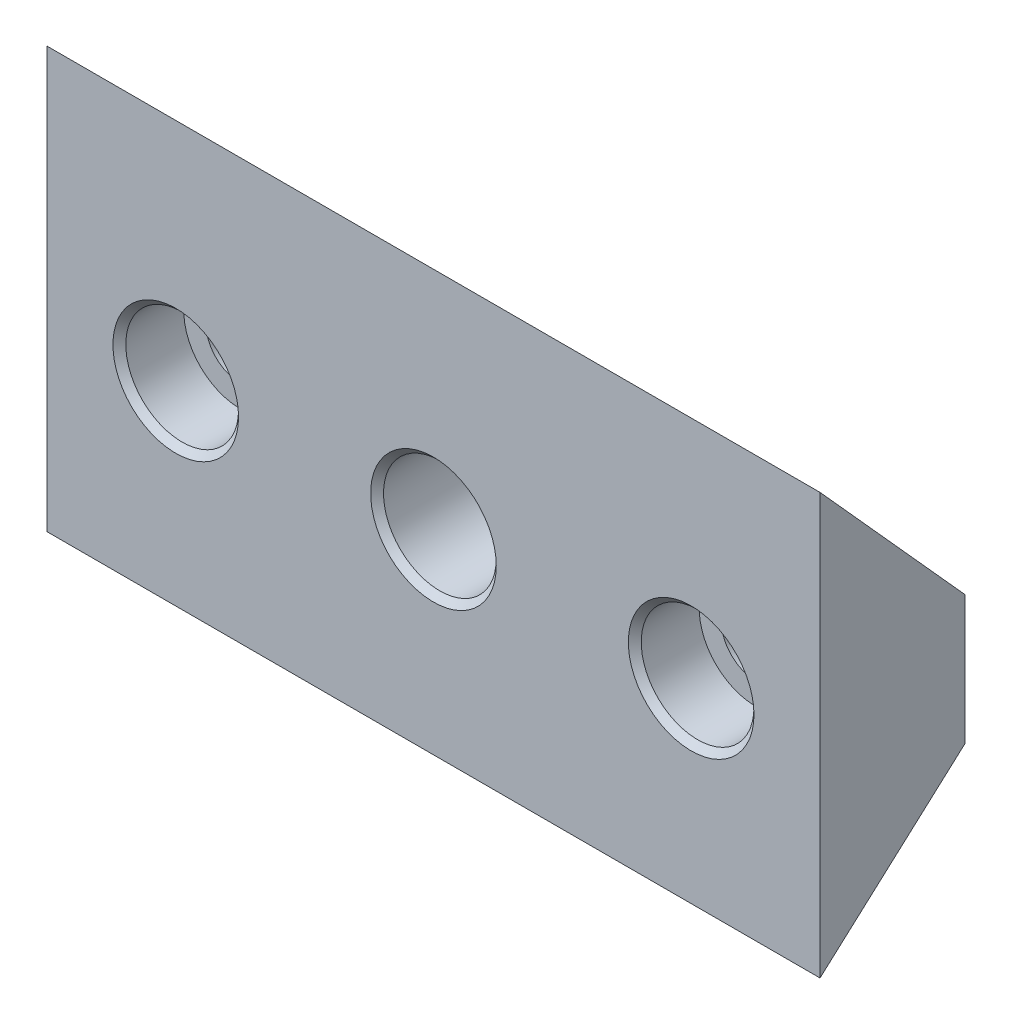
ISO-10303-21;
HEADER;
FILE_DESCRIPTION(('STEP AP214'),'2;1');
FILE_NAME('part.step','',(''),(''),'','','');
FILE_SCHEMA(('AUTOMOTIVE_DESIGN { 1 0 10303 214 1 1 1 1 }'));
ENDSEC;
DATA;
#1=APPLICATION_CONTEXT('core data for automotive mechanical design processes');
#2=APPLICATION_PROTOCOL_DEFINITION('international standard','automotive_design',2000,#1);
#3=PRODUCT_CONTEXT('',#1,'mechanical');
#4=PRODUCT('Part','Part','',(#3));
#5=PRODUCT_RELATED_PRODUCT_CATEGORY('part','',(#4));
#6=PRODUCT_DEFINITION_FORMATION('','',#4);
#7=PRODUCT_DEFINITION_CONTEXT('part definition',#1,'design');
#8=PRODUCT_DEFINITION('design','',#6,#7);
#9=PRODUCT_DEFINITION_SHAPE('','',#8);
#10=(LENGTH_UNIT() NAMED_UNIT(*) SI_UNIT(.MILLI.,.METRE.));
#11=(NAMED_UNIT(*) PLANE_ANGLE_UNIT() SI_UNIT($,.RADIAN.));
#12=(NAMED_UNIT(*) SI_UNIT($,.STERADIAN.) SOLID_ANGLE_UNIT());
#13=UNCERTAINTY_MEASURE_WITH_UNIT(LENGTH_MEASURE(1.E-05),#10,'distance_accuracy_value','');
#14=(GEOMETRIC_REPRESENTATION_CONTEXT(3) GLOBAL_UNCERTAINTY_ASSIGNED_CONTEXT((#13)) GLOBAL_UNIT_ASSIGNED_CONTEXT((#10,
#11,#12)) REPRESENTATION_CONTEXT('',''));
#15=CARTESIAN_POINT('',(0.,0.,0.));
#16=DIRECTION('',(0.,0.,1.));
#17=DIRECTION('',(1.,0.,0.));
#18=AXIS2_PLACEMENT_3D('',#15,#16,#17);
#19=CARTESIAN_POINT('',(-38.1,22.225,7.1501));
#20=DIRECTION('',(1.,0.,0.));
#21=DIRECTION('',(0.,1.,0.));
#22=AXIS2_PLACEMENT_3D('',#19,#20,#21);
#23=PLANE('',#22);
#24=DIRECTION('',(0.,0.743144825477396,-0.669130606358856));
#25=VECTOR('',#24,1.);
#26=CARTESIAN_POINT('',(-38.1,-6.39546194990181,-7.10288007967489));
#27=LINE('',#26,#25);
#28=CARTESIAN_POINT('',(-38.1,-6.37990268068199,-7.11688970860673));
#29=VERTEX_POINT('',#28);
#30=CARTESIAN_POINT('',(-38.1,-6.3430189154395,-7.1501));
#31=VERTEX_POINT('',#30);
#32=EDGE_CURVE('E105',#29,#31,#27,.T.);
#33=ORIENTED_EDGE('',*,*,#32,.F.);
#34=DIRECTION('',(0.,-0.669130606358859,0.743144825477394));
#35=VECTOR('',#34,1.);
#36=CARTESIAN_POINT('',(-38.1,-6.34999999999986,-7.15009999999925));
#37=LINE('',#36,#35);
#38=CARTESIAN_POINT('',(-38.1,-19.2259579142672,7.1501));
#39=VERTEX_POINT('',#38);
#40=EDGE_CURVE('E56',#29,#39,#37,.T.);
#41=ORIENTED_EDGE('',*,*,#40,.T.);
#42=DIRECTION('',(0.,-1.,0.));
#43=VECTOR('',#42,1.);
#44=CARTESIAN_POINT('',(-38.1,22.225,7.1501));
#45=LINE('',#44,#43);
#46=CARTESIAN_POINT('',(-38.1,22.225,7.1501));
#47=VERTEX_POINT('',#46);
#48=EDGE_CURVE('E119',#47,#39,#45,.T.);
#49=ORIENTED_EDGE('',*,*,#48,.F.);
#50=DIRECTION('',(0.,-0.743144825477396,-0.669130606358856));
#51=VECTOR('',#50,1.);
#52=CARTESIAN_POINT('',(-38.1,6.3954619499018,-7.10288007967489));
#53=LINE('',#52,#51);
#54=CARTESIAN_POINT('',(-38.1,6.3430189154395,-7.1501));
#55=VERTEX_POINT('',#54);
#56=EDGE_CURVE('E109',#47,#55,#53,.T.);
#57=ORIENTED_EDGE('',*,*,#56,.T.);
#58=DIRECTION('',(0.,-1.,0.));
#59=VECTOR('',#58,1.);
#60=CARTESIAN_POINT('',(-38.1,22.225,-7.1501));
#61=LINE('',#60,#59);
#62=EDGE_CURVE('E114',#55,#31,#61,.T.);
#63=ORIENTED_EDGE('',*,*,#62,.T.);
#64=EDGE_LOOP('',(#33,#41,#49,#57,#63));
#65=FACE_BOUND('',#64,.T.);
#66=ADVANCED_FACE('F43',(#65),#23,.F.);
#67=CARTESIAN_POINT('',(38.1,22.225,7.1501));
#68=DIRECTION('',(-1.,0.,0.));
#69=DIRECTION('',(0.,0.,1.));
#70=AXIS2_PLACEMENT_3D('',#67,#68,#69);
#71=PLANE('',#70);
#72=DIRECTION('',(0.,1.,0.));
#73=VECTOR('',#72,1.);
#74=CARTESIAN_POINT('',(38.1,22.225,7.1501));
#75=LINE('',#74,#73);
#76=CARTESIAN_POINT('',(38.1,-19.2259579142672,7.1501));
#77=VERTEX_POINT('',#76);
#78=CARTESIAN_POINT('',(38.1,22.225,7.1501));
#79=VERTEX_POINT('',#78);
#80=EDGE_CURVE('E99',#77,#79,#75,.T.);
#81=ORIENTED_EDGE('',*,*,#80,.F.);
#82=DIRECTION('',(0.,-0.669130606358859,0.743144825477394));
#83=VECTOR('',#82,1.);
#84=CARTESIAN_POINT('',(38.1,-6.34999999999986,-7.15009999999925));
#85=LINE('',#84,#83);
#86=CARTESIAN_POINT('',(38.1,-6.37990268068198,-7.11688970860675));
#87=VERTEX_POINT('',#86);
#88=EDGE_CURVE('E88',#87,#77,#85,.T.);
#89=ORIENTED_EDGE('',*,*,#88,.F.);
#90=DIRECTION('',(0.,0.743144825477396,-0.669130606358856));
#91=VECTOR('',#90,1.);
#92=CARTESIAN_POINT('',(38.1,-6.39546194990181,-7.10288007967489));
#93=LINE('',#92,#91);
#94=CARTESIAN_POINT('',(38.1,-6.3430189154395,-7.1501));
#95=VERTEX_POINT('',#94);
#96=EDGE_CURVE('E97',#87,#95,#93,.T.);
#97=ORIENTED_EDGE('',*,*,#96,.T.);
#98=DIRECTION('',(0.,1.,0.));
#99=VECTOR('',#98,1.);
#100=CARTESIAN_POINT('',(38.1,22.225,-7.1501));
#101=LINE('',#100,#99);
#102=CARTESIAN_POINT('',(38.1,6.3430189154395,-7.1501));
#103=VERTEX_POINT('',#102);
#104=EDGE_CURVE('E122',#95,#103,#101,.T.);
#105=ORIENTED_EDGE('',*,*,#104,.T.);
#106=DIRECTION('',(0.,-0.743144825477396,-0.669130606358856));
#107=VECTOR('',#106,1.);
#108=CARTESIAN_POINT('',(38.1,6.3954619499018,-7.10288007967489));
#109=LINE('',#108,#107);
#110=EDGE_CURVE('E64',#79,#103,#109,.T.);
#111=ORIENTED_EDGE('',*,*,#110,.F.);
#112=EDGE_LOOP('',(#81,#89,#97,#105,#111));
#113=FACE_BOUND('',#112,.T.);
#114=ADVANCED_FACE('F95',(#113),#71,.F.);
#115=CARTESIAN_POINT('',(0.,0.,-7.1501));
#116=DIRECTION('',(0.,0.,-1.));
#117=DIRECTION('',(-1.,0.,0.));
#118=AXIS2_PLACEMENT_3D('',#115,#116,#117);
#119=PLANE('',#118);
#120=CARTESIAN_POINT('',(0.,0.,-7.1501));
#121=DIRECTION('',(0.,0.,1.));
#122=DIRECTION('',(1.,0.,0.));
#123=AXIS2_PLACEMENT_3D('',#120,#121,#122);
#124=CIRCLE('',#123,6.19125);
#125=CARTESIAN_POINT('',(6.19125,0.,-7.1501));
#126=VERTEX_POINT('',#125);
#127=EDGE_CURVE('E136',#126,#126,#124,.T.);
#128=ORIENTED_EDGE('',*,*,#127,.T.);
#129=EDGE_LOOP('',(#128));
#130=FACE_BOUND('',#129,.T.);
#131=CARTESIAN_POINT('',(-25.4,0.,-7.1501));
#132=DIRECTION('',(0.,0.,1.));
#133=DIRECTION('',(1.,0.,0.));
#134=AXIS2_PLACEMENT_3D('',#131,#132,#133);
#135=CIRCLE('',#134,4.0132);
#136=CARTESIAN_POINT('',(-21.3868,0.,-7.1501));
#137=VERTEX_POINT('',#136);
#138=EDGE_CURVE('E151',#137,#137,#135,.T.);
#139=ORIENTED_EDGE('',*,*,#138,.T.);
#140=EDGE_LOOP('',(#139));
#141=FACE_BOUND('',#140,.T.);
#142=CARTESIAN_POINT('',(25.4,0.,-7.1501));
#143=DIRECTION('',(0.,0.,1.));
#144=DIRECTION('',(1.,0.,0.));
#145=AXIS2_PLACEMENT_3D('',#142,#143,#144);
#146=CIRCLE('',#145,4.01319999999999);
#147=CARTESIAN_POINT('',(29.4132,0.,-7.1501));
#148=VERTEX_POINT('',#147);
#149=EDGE_CURVE('E169',#148,#148,#146,.T.);
#150=ORIENTED_EDGE('',*,*,#149,.T.);
#151=EDGE_LOOP('',(#150));
#152=FACE_BOUND('',#151,.T.);
#153=ORIENTED_EDGE('',*,*,#104,.F.);
#154=DIRECTION('',(1.,0.,0.));
#155=VECTOR('',#154,1.);
#156=CARTESIAN_POINT('',(-38.1,-6.3430189154395,-7.1501));
#157=LINE('',#156,#155);
#158=EDGE_CURVE('E103',#31,#95,#157,.T.);
#159=ORIENTED_EDGE('',*,*,#158,.F.);
#160=ORIENTED_EDGE('',*,*,#62,.F.);
#161=DIRECTION('',(1.,0.,0.));
#162=VECTOR('',#161,1.);
#163=CARTESIAN_POINT('',(-38.1,6.3430189154395,-7.1501));
#164=LINE('',#163,#162);
#165=EDGE_CURVE('E106',#55,#103,#164,.T.);
#166=ORIENTED_EDGE('',*,*,#165,.T.);
#167=EDGE_LOOP('',(#153,#159,#160,#166));
#168=FACE_BOUND('',#167,.T.);
#169=ADVANCED_FACE('F128',(#130,#141,#152,#168),#119,.T.);
#170=CARTESIAN_POINT('',(0.,0.,7.1501));
#171=DIRECTION('',(0.,0.,-1.));
#172=DIRECTION('',(-1.,0.,0.));
#173=AXIS2_PLACEMENT_3D('',#170,#171,#172);
#174=PLANE('',#173);
#175=CARTESIAN_POINT('',(0.,0.,7.1501));
#176=DIRECTION('',(0.,0.,1.));
#177=DIRECTION('',(1.,0.,0.));
#178=AXIS2_PLACEMENT_3D('',#175,#176,#177);
#179=CIRCLE('',#178,6.19125);
#180=CARTESIAN_POINT('',(6.19125,0.,7.1501));
#181=VERTEX_POINT('',#180);
#182=EDGE_CURVE('E139',#181,#181,#179,.T.);
#183=ORIENTED_EDGE('',*,*,#182,.F.);
#184=EDGE_LOOP('',(#183));
#185=FACE_BOUND('',#184,.T.);
#186=CARTESIAN_POINT('',(-25.4,0.,7.1501));
#187=DIRECTION('',(0.,0.,1.));
#188=DIRECTION('',(1.,0.,0.));
#189=AXIS2_PLACEMENT_3D('',#186,#187,#188);
#190=CIRCLE('',#189,6.19125);
#191=CARTESIAN_POINT('',(-19.20875,0.,7.1501));
#192=VERTEX_POINT('',#191);
#193=EDGE_CURVE('E154',#192,#192,#190,.T.);
#194=ORIENTED_EDGE('',*,*,#193,.F.);
#195=EDGE_LOOP('',(#194));
#196=FACE_BOUND('',#195,.T.);
#197=CARTESIAN_POINT('',(25.4,0.,7.1501));
#198=DIRECTION('',(0.,0.,1.));
#199=DIRECTION('',(1.,0.,0.));
#200=AXIS2_PLACEMENT_3D('',#197,#198,#199);
#201=CIRCLE('',#200,6.19125);
#202=CARTESIAN_POINT('',(31.59125,0.,7.1501));
#203=VERTEX_POINT('',#202);
#204=EDGE_CURVE('E172',#203,#203,#201,.T.);
#205=ORIENTED_EDGE('',*,*,#204,.F.);
#206=EDGE_LOOP('',(#205));
#207=FACE_BOUND('',#206,.T.);
#208=ORIENTED_EDGE('',*,*,#48,.T.);
#209=DIRECTION('',(1.,0.,0.));
#210=VECTOR('',#209,1.);
#211=CARTESIAN_POINT('',(0.,-19.2259579142672,7.1501));
#212=LINE('',#211,#210);
#213=EDGE_CURVE('E135',#39,#77,#212,.T.);
#214=ORIENTED_EDGE('',*,*,#213,.T.);
#215=ORIENTED_EDGE('',*,*,#80,.T.);
#216=DIRECTION('',(-1.,0.,0.));
#217=VECTOR('',#216,1.);
#218=CARTESIAN_POINT('',(38.1,22.225,7.1501));
#219=LINE('',#218,#217);
#220=EDGE_CURVE('E50',#79,#47,#219,.T.);
#221=ORIENTED_EDGE('',*,*,#220,.T.);
#222=EDGE_LOOP('',(#208,#214,#215,#221));
#223=FACE_BOUND('',#222,.T.);
#224=ADVANCED_FACE('F134',(#185,#196,#207,#223),#174,.F.);
#225=CARTESIAN_POINT('',(-38.1,6.3954619499018,-7.10288007967489));
#226=DIRECTION('',(0.,-0.669130606358856,0.743144825477396));
#227=DIRECTION('',(0.,-0.743144825477396,-0.669130606358856));
#228=AXIS2_PLACEMENT_3D('',#225,#226,#227);
#229=PLANE('',#228);
#230=ORIENTED_EDGE('',*,*,#110,.T.);
#231=ORIENTED_EDGE('',*,*,#165,.F.);
#232=ORIENTED_EDGE('',*,*,#56,.F.);
#233=ORIENTED_EDGE('',*,*,#220,.F.);
#234=EDGE_LOOP('',(#230,#231,#232,#233));
#235=FACE_BOUND('',#234,.T.);
#236=ADVANCED_FACE('F130',(#235),#229,.F.);
#237=CARTESIAN_POINT('',(-38.1,-6.39546194990181,-7.10288007967489));
#238=DIRECTION('',(0.,-0.669130606358856,-0.743144825477396));
#239=DIRECTION('',(0.,0.743144825477396,-0.669130606358856));
#240=AXIS2_PLACEMENT_3D('',#237,#238,#239);
#241=PLANE('',#240);
#242=DIRECTION('',(1.,0.,0.));
#243=VECTOR('',#242,1.);
#244=CARTESIAN_POINT('',(-38.1,-6.37990268068199,-7.11688970860673));
#245=LINE('',#244,#243);
#246=EDGE_CURVE('E11',#29,#87,#245,.T.);
#247=ORIENTED_EDGE('',*,*,#246,.F.);
#248=ORIENTED_EDGE('',*,*,#32,.T.);
#249=ORIENTED_EDGE('',*,*,#158,.T.);
#250=ORIENTED_EDGE('',*,*,#96,.F.);
#251=EDGE_LOOP('',(#247,#248,#249,#250));
#252=FACE_BOUND('',#251,.T.);
#253=ADVANCED_FACE('F101',(#252),#241,.T.);
#254=CARTESIAN_POINT('',(25.4,0.,-6.5151));
#255=DIRECTION('',(0.,0.,-1.));
#256=DIRECTION('',(-1.,0.,0.));
#257=AXIS2_PLACEMENT_3D('',#254,#255,#256);
#258=CONICAL_SURFACE('',#257,3.3782,0.785398163397447);
#259=ORIENTED_EDGE('',*,*,#149,.F.);
#260=EDGE_LOOP('',(#259));
#261=FACE_BOUND('',#260,.T.);
#262=CARTESIAN_POINT('',(25.4,0.,-6.5151));
#263=DIRECTION('',(0.,0.,1.));
#264=DIRECTION('',(1.,0.,0.));
#265=AXIS2_PLACEMENT_3D('',#262,#263,#264);
#266=CIRCLE('',#265,3.3782);
#267=CARTESIAN_POINT('',(28.7782,0.,-6.5151));
#268=VERTEX_POINT('',#267);
#269=EDGE_CURVE('E117',#268,#268,#266,.T.);
#270=ORIENTED_EDGE('',*,*,#269,.T.);
#271=EDGE_LOOP('',(#270));
#272=FACE_BOUND('',#271,.T.);
#273=ADVANCED_FACE('F186',(#261,#272),#258,.F.);
#274=CARTESIAN_POINT('',(25.4,0.,7.1501));
#275=DIRECTION('',(0.,0.,1.));
#276=DIRECTION('',(1.,0.,0.));
#277=AXIS2_PLACEMENT_3D('',#274,#275,#276);
#278=CYLINDRICAL_SURFACE('',#277,3.3782);
#279=ORIENTED_EDGE('',*,*,#269,.F.);
#280=EDGE_LOOP('',(#279));
#281=FACE_BOUND('',#280,.T.);
#282=CARTESIAN_POINT('',(25.4,0.,0.800100000000001));
#283=DIRECTION('',(0.,0.,1.));
#284=DIRECTION('',(1.,0.,0.));
#285=AXIS2_PLACEMENT_3D('',#282,#283,#284);
#286=CIRCLE('',#285,3.3782);
#287=CARTESIAN_POINT('',(28.7782,0.,0.800100000000001));
#288=VERTEX_POINT('',#287);
#289=EDGE_CURVE('E181',#288,#288,#286,.T.);
#290=ORIENTED_EDGE('',*,*,#289,.T.);
#291=EDGE_LOOP('',(#290));
#292=FACE_BOUND('',#291,.T.);
#293=ADVANCED_FACE('F188',(#281,#292),#278,.F.);
#294=CARTESIAN_POINT('',(30.95625,0.,0.800100000000001));
#295=DIRECTION('',(0.,0.,-1.));
#296=DIRECTION('',(-1.,0.,0.));
#297=AXIS2_PLACEMENT_3D('',#294,#295,#296);
#298=PLANE('',#297);
#299=ORIENTED_EDGE('',*,*,#289,.F.);
#300=EDGE_LOOP('',(#299));
#301=FACE_BOUND('',#300,.T.);
#302=CARTESIAN_POINT('',(25.4,0.,0.800100000000001));
#303=DIRECTION('',(0.,0.,1.));
#304=DIRECTION('',(1.,0.,0.));
#305=AXIS2_PLACEMENT_3D('',#302,#303,#304);
#306=CIRCLE('',#305,5.55625);
#307=CARTESIAN_POINT('',(30.95625,0.,0.800100000000001));
#308=VERTEX_POINT('',#307);
#309=EDGE_CURVE('E178',#308,#308,#306,.T.);
#310=ORIENTED_EDGE('',*,*,#309,.T.);
#311=EDGE_LOOP('',(#310));
#312=FACE_BOUND('',#311,.T.);
#313=ADVANCED_FACE('F191',(#301,#312),#298,.F.);
#314=CARTESIAN_POINT('',(25.4,0.,7.1501));
#315=DIRECTION('',(0.,0.,1.));
#316=DIRECTION('',(1.,0.,0.));
#317=AXIS2_PLACEMENT_3D('',#314,#315,#316);
#318=CYLINDRICAL_SURFACE('',#317,5.55625);
#319=ORIENTED_EDGE('',*,*,#309,.F.);
#320=EDGE_LOOP('',(#319));
#321=FACE_BOUND('',#320,.T.);
#322=CARTESIAN_POINT('',(25.4,0.,6.5151));
#323=DIRECTION('',(0.,0.,1.));
#324=DIRECTION('',(1.,0.,0.));
#325=AXIS2_PLACEMENT_3D('',#322,#323,#324);
#326=CIRCLE('',#325,5.55625);
#327=CARTESIAN_POINT('',(30.95625,0.,6.5151));
#328=VERTEX_POINT('',#327);
#329=EDGE_CURVE('E175',#328,#328,#326,.T.);
#330=ORIENTED_EDGE('',*,*,#329,.T.);
#331=EDGE_LOOP('',(#330));
#332=FACE_BOUND('',#331,.T.);
#333=ADVANCED_FACE('F197',(#321,#332),#318,.F.);
#334=CARTESIAN_POINT('',(25.4,0.,7.1501));
#335=DIRECTION('',(0.,0.,1.));
#336=DIRECTION('',(1.,0.,0.));
#337=AXIS2_PLACEMENT_3D('',#334,#335,#336);
#338=CONICAL_SURFACE('',#337,6.19125,0.785398163397442);
#339=ORIENTED_EDGE('',*,*,#329,.F.);
#340=EDGE_LOOP('',(#339));
#341=FACE_BOUND('',#340,.T.);
#342=ORIENTED_EDGE('',*,*,#204,.T.);
#343=EDGE_LOOP('',(#342));
#344=FACE_BOUND('',#343,.T.);
#345=ADVANCED_FACE('F203',(#341,#344),#338,.F.);
#346=CARTESIAN_POINT('',(-25.4,0.,-6.5151));
#347=DIRECTION('',(0.,0.,-1.));
#348=DIRECTION('',(-1.,0.,0.));
#349=AXIS2_PLACEMENT_3D('',#346,#347,#348);
#350=CONICAL_SURFACE('',#349,3.3782,0.78539816339745);
#351=ORIENTED_EDGE('',*,*,#138,.F.);
#352=EDGE_LOOP('',(#351));
#353=FACE_BOUND('',#352,.T.);
#354=CARTESIAN_POINT('',(-25.4,0.,-6.5151));
#355=DIRECTION('',(0.,0.,1.));
#356=DIRECTION('',(1.,0.,0.));
#357=AXIS2_PLACEMENT_3D('',#354,#355,#356);
#358=CIRCLE('',#357,3.3782);
#359=CARTESIAN_POINT('',(-22.0218,0.,-6.5151));
#360=VERTEX_POINT('',#359);
#361=EDGE_CURVE('E166',#360,#360,#358,.T.);
#362=ORIENTED_EDGE('',*,*,#361,.T.);
#363=EDGE_LOOP('',(#362));
#364=FACE_BOUND('',#363,.T.);
#365=ADVANCED_FACE('F209',(#353,#364),#350,.F.);
#366=CARTESIAN_POINT('',(-25.4,0.,7.1501));
#367=DIRECTION('',(0.,0.,1.));
#368=DIRECTION('',(1.,0.,0.));
#369=AXIS2_PLACEMENT_3D('',#366,#367,#368);
#370=CYLINDRICAL_SURFACE('',#369,3.3782);
#371=ORIENTED_EDGE('',*,*,#361,.F.);
#372=EDGE_LOOP('',(#371));
#373=FACE_BOUND('',#372,.T.);
#374=CARTESIAN_POINT('',(-25.4,0.,0.800100000000001));
#375=DIRECTION('',(0.,0.,1.));
#376=DIRECTION('',(1.,0.,0.));
#377=AXIS2_PLACEMENT_3D('',#374,#375,#376);
#378=CIRCLE('',#377,3.3782);
#379=CARTESIAN_POINT('',(-22.0218,0.,0.800100000000001));
#380=VERTEX_POINT('',#379);
#381=EDGE_CURVE('E163',#380,#380,#378,.T.);
#382=ORIENTED_EDGE('',*,*,#381,.T.);
#383=EDGE_LOOP('',(#382));
#384=FACE_BOUND('',#383,.T.);
#385=ADVANCED_FACE('F278',(#373,#384),#370,.F.);
#386=CARTESIAN_POINT('',(-19.84375,0.,0.800100000000001));
#387=DIRECTION('',(0.,0.,-1.));
#388=DIRECTION('',(-1.,0.,0.));
#389=AXIS2_PLACEMENT_3D('',#386,#387,#388);
#390=PLANE('',#389);
#391=ORIENTED_EDGE('',*,*,#381,.F.);
#392=EDGE_LOOP('',(#391));
#393=FACE_BOUND('',#392,.T.);
#394=CARTESIAN_POINT('',(-25.4,0.,0.800100000000001));
#395=DIRECTION('',(0.,0.,1.));
#396=DIRECTION('',(1.,0.,0.));
#397=AXIS2_PLACEMENT_3D('',#394,#395,#396);
#398=CIRCLE('',#397,5.55625);
#399=CARTESIAN_POINT('',(-19.84375,0.,0.800100000000001));
#400=VERTEX_POINT('',#399);
#401=EDGE_CURVE('E160',#400,#400,#398,.T.);
#402=ORIENTED_EDGE('',*,*,#401,.T.);
#403=EDGE_LOOP('',(#402));
#404=FACE_BOUND('',#403,.T.);
#405=ADVANCED_FACE('F286',(#393,#404),#390,.F.);
#406=CARTESIAN_POINT('',(-25.4,0.,7.1501));
#407=DIRECTION('',(0.,0.,1.));
#408=DIRECTION('',(1.,0.,0.));
#409=AXIS2_PLACEMENT_3D('',#406,#407,#408);
#410=CYLINDRICAL_SURFACE('',#409,5.55625);
#411=ORIENTED_EDGE('',*,*,#401,.F.);
#412=EDGE_LOOP('',(#411));
#413=FACE_BOUND('',#412,.T.);
#414=CARTESIAN_POINT('',(-25.4,0.,6.5151));
#415=DIRECTION('',(0.,0.,1.));
#416=DIRECTION('',(1.,0.,0.));
#417=AXIS2_PLACEMENT_3D('',#414,#415,#416);
#418=CIRCLE('',#417,5.55625);
#419=CARTESIAN_POINT('',(-19.84375,0.,6.5151));
#420=VERTEX_POINT('',#419);
#421=EDGE_CURVE('E157',#420,#420,#418,.T.);
#422=ORIENTED_EDGE('',*,*,#421,.T.);
#423=EDGE_LOOP('',(#422));
#424=FACE_BOUND('',#423,.T.);
#425=ADVANCED_FACE('F294',(#413,#424),#410,.F.);
#426=CARTESIAN_POINT('',(-25.4,0.,7.1501));
#427=DIRECTION('',(0.,0.,1.));
#428=DIRECTION('',(1.,0.,0.));
#429=AXIS2_PLACEMENT_3D('',#426,#427,#428);
#430=CONICAL_SURFACE('',#429,6.19125,0.785398163397445);
#431=ORIENTED_EDGE('',*,*,#421,.F.);
#432=EDGE_LOOP('',(#431));
#433=FACE_BOUND('',#432,.T.);
#434=ORIENTED_EDGE('',*,*,#193,.T.);
#435=EDGE_LOOP('',(#434));
#436=FACE_BOUND('',#435,.T.);
#437=ADVANCED_FACE('F302',(#433,#436),#430,.F.);
#438=CARTESIAN_POINT('',(0.,0.,-6.5151));
#439=DIRECTION('',(0.,0.,-1.));
#440=DIRECTION('',(-1.,0.,0.));
#441=AXIS2_PLACEMENT_3D('',#438,#439,#440);
#442=CONICAL_SURFACE('',#441,5.55625,0.785398163397448);
#443=ORIENTED_EDGE('',*,*,#127,.F.);
#444=EDGE_LOOP('',(#443));
#445=FACE_BOUND('',#444,.T.);
#446=CARTESIAN_POINT('',(0.,0.,-6.5151));
#447=DIRECTION('',(0.,0.,1.));
#448=DIRECTION('',(1.,0.,0.));
#449=AXIS2_PLACEMENT_3D('',#446,#447,#448);
#450=CIRCLE('',#449,5.55625);
#451=CARTESIAN_POINT('',(5.55625,0.,-6.5151));
#452=VERTEX_POINT('',#451);
#453=EDGE_CURVE('E148',#452,#452,#450,.T.);
#454=ORIENTED_EDGE('',*,*,#453,.T.);
#455=EDGE_LOOP('',(#454));
#456=FACE_BOUND('',#455,.T.);
#457=ADVANCED_FACE('F310',(#445,#456),#442,.F.);
#458=CARTESIAN_POINT('',(0.,0.,7.1501));
#459=DIRECTION('',(0.,0.,1.));
#460=DIRECTION('',(1.,0.,0.));
#461=AXIS2_PLACEMENT_3D('',#458,#459,#460);
#462=CYLINDRICAL_SURFACE('',#461,5.55625);
#463=ORIENTED_EDGE('',*,*,#453,.F.);
#464=EDGE_LOOP('',(#463));
#465=FACE_BOUND('',#464,.T.);
#466=CARTESIAN_POINT('',(0.,0.,6.5151));
#467=DIRECTION('',(0.,0.,1.));
#468=DIRECTION('',(1.,0.,0.));
#469=AXIS2_PLACEMENT_3D('',#466,#467,#468);
#470=CIRCLE('',#469,5.55625);
#471=CARTESIAN_POINT('',(5.55625,0.,6.5151));
#472=VERTEX_POINT('',#471);
#473=EDGE_CURVE('E145',#472,#472,#470,.T.);
#474=ORIENTED_EDGE('',*,*,#473,.T.);
#475=EDGE_LOOP('',(#474));
#476=FACE_BOUND('',#475,.T.);
#477=ADVANCED_FACE('F318',(#465,#476),#462,.F.);
#478=CARTESIAN_POINT('',(0.,0.,7.1501));
#479=DIRECTION('',(0.,0.,1.));
#480=DIRECTION('',(1.,0.,0.));
#481=AXIS2_PLACEMENT_3D('',#478,#479,#480);
#482=CONICAL_SURFACE('',#481,6.19125,0.78539816339745);
#483=ORIENTED_EDGE('',*,*,#473,.F.);
#484=EDGE_LOOP('',(#483));
#485=FACE_BOUND('',#484,.T.);
#486=ORIENTED_EDGE('',*,*,#182,.T.);
#487=EDGE_LOOP('',(#486));
#488=FACE_BOUND('',#487,.T.);
#489=ADVANCED_FACE('F326',(#485,#488),#482,.F.);
#490=CARTESIAN_POINT('',(-38.1,-6.34999999999986,-7.15009999999925));
#491=DIRECTION('',(0.,0.743144825477394,0.669130606358859));
#492=DIRECTION('',(0.,0.669130606358859,-0.743144825477394));
#493=AXIS2_PLACEMENT_3D('',#490,#491,#492);
#494=PLANE('',#493);
#495=ORIENTED_EDGE('',*,*,#40,.F.);
#496=ORIENTED_EDGE('',*,*,#246,.T.);
#497=ORIENTED_EDGE('',*,*,#88,.T.);
#498=ORIENTED_EDGE('',*,*,#213,.F.);
#499=EDGE_LOOP('',(#495,#496,#497,#498));
#500=FACE_BOUND('',#499,.T.);
#501=ADVANCED_FACE('F87',(#500),#494,.F.);
#502=CLOSED_SHELL('',(#66,#114,#169,#224,#236,#253,#273,#293,#313,#333,#345,#365,#385,#405,#425,
#437,#457,#477,#489,#501));
#503=MANIFOLD_SOLID_BREP('B2',#502);
#504=ADVANCED_BREP_SHAPE_REPRESENTATION('',(#18,#503),#14);
#505=SHAPE_DEFINITION_REPRESENTATION(#9,#504);
ENDSEC;
END-ISO-10303-21;
